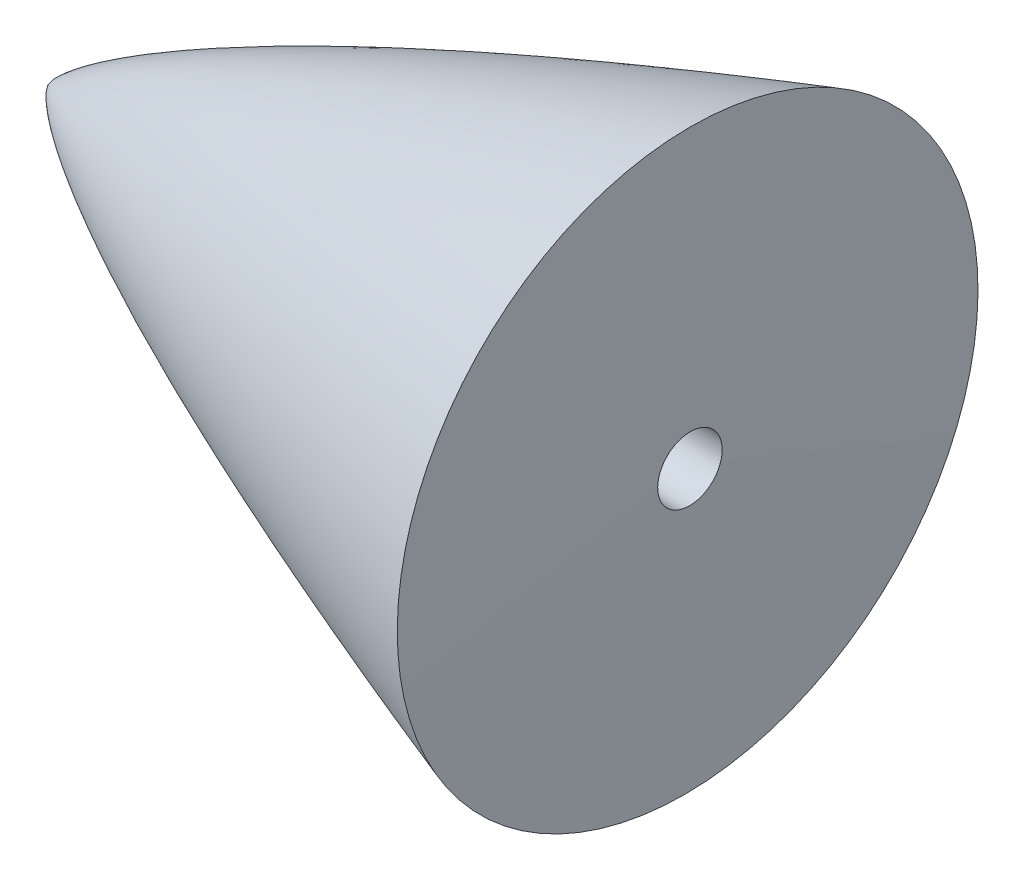
ISO-10303-21;
HEADER;
FILE_DESCRIPTION(('STEP AP214'),'2;1');
FILE_NAME('part.step','',(''),(''),'','','');
FILE_SCHEMA(('AUTOMOTIVE_DESIGN { 1 0 10303 214 1 1 1 1 }'));
ENDSEC;
DATA;
#1=APPLICATION_CONTEXT('core data for automotive mechanical design processes');
#2=APPLICATION_PROTOCOL_DEFINITION('international standard','automotive_design',2000,#1);
#3=PRODUCT_CONTEXT('',#1,'mechanical');
#4=PRODUCT('Part','Part','',(#3));
#5=PRODUCT_RELATED_PRODUCT_CATEGORY('part','',(#4));
#6=PRODUCT_DEFINITION_FORMATION('','',#4);
#7=PRODUCT_DEFINITION_CONTEXT('part definition',#1,'design');
#8=PRODUCT_DEFINITION('design','',#6,#7);
#9=PRODUCT_DEFINITION_SHAPE('','',#8);
#10=(LENGTH_UNIT() NAMED_UNIT(*) SI_UNIT(.MILLI.,.METRE.));
#11=(NAMED_UNIT(*) PLANE_ANGLE_UNIT() SI_UNIT($,.RADIAN.));
#12=(NAMED_UNIT(*) SI_UNIT($,.STERADIAN.) SOLID_ANGLE_UNIT());
#13=UNCERTAINTY_MEASURE_WITH_UNIT(LENGTH_MEASURE(1.E-05),#10,'distance_accuracy_value','');
#14=(GEOMETRIC_REPRESENTATION_CONTEXT(3) GLOBAL_UNCERTAINTY_ASSIGNED_CONTEXT((#13)) GLOBAL_UNIT_ASSIGNED_CONTEXT((#10,
#11,#12)) REPRESENTATION_CONTEXT('',''));
#15=CARTESIAN_POINT('',(0.,0.,0.));
#16=DIRECTION('',(0.,0.,1.));
#17=DIRECTION('',(1.,0.,0.));
#18=AXIS2_PLACEMENT_3D('',#15,#16,#17);
#19=CARTESIAN_POINT('',(50.8000000000005,22.5303567600831,0.));
#20=CARTESIAN_POINT('',(50.3465117854958,22.3812512382409,0.));
#21=CARTESIAN_POINT('',(49.442710434982,22.0829308392967,0.));
#22=CARTESIAN_POINT('',(47.1773804594535,21.3310775343089,0.));
#23=CARTESIAN_POINT('',(44.9449824900996,20.575969254353,0.));
#24=CARTESIAN_POINT('',(42.3170495750487,19.6775947745826,0.));
#25=CARTESIAN_POINT('',(39.9342074399655,18.8455213654888,0.));
#26=CARTESIAN_POINT('',(37.9136867647819,18.1332544680412,0.));
#27=CARTESIAN_POINT('',(35.9736316381102,17.4378758859734,0.));
#28=CARTESIAN_POINT('',(33.9915603629898,16.7185301483629,0.));
#29=CARTESIAN_POINT('',(31.5467375732389,15.8166109871259,0.));
#30=CARTESIAN_POINT('',(28.6052755986588,14.7086926881745,0.));
#31=CARTESIAN_POINT('',(25.195617979637,13.3860362700775,0.));
#32=CARTESIAN_POINT('',(21.3140120710095,11.8194498266795,0.));
#33=CARTESIAN_POINT('',(17.4617236726198,10.1904945755756,0.));
#34=CARTESIAN_POINT('',(13.6413400190153,8.48273894782136,0.));
#35=CARTESIAN_POINT('',(10.0936400641903,6.78232850197087,0.));
#36=CARTESIAN_POINT('',(7.06866265457857,5.20317059368231,0.));
#37=CARTESIAN_POINT('',(4.68834287270004,3.82830118825915,0.));
#38=CARTESIAN_POINT('',(3.03757211642044,2.76626899081453,0.));
#39=CARTESIAN_POINT('',(1.94795210676624,1.98434624807816,0.));
#40=CARTESIAN_POINT('',(1.22079366392824,1.39852484429859,0.));
#41=CARTESIAN_POINT('',(0.755145997118583,0.975924582867757,0.));
#42=CARTESIAN_POINT('',(0.461319422784189,0.674703687613275,0.));
#43=CARTESIAN_POINT('',(0.27829904475557,0.462127291497044,0.));
#44=CARTESIAN_POINT('',(0.165033444135209,0.312533910105992,0.));
#45=CARTESIAN_POINT('',(0.0968927723109344,0.209644328942817,0.));
#46=CARTESIAN_POINT('',(0.0563614371928829,0.139758552997633,0.));
#47=CARTESIAN_POINT('',(0.0275961366881815,0.0824356831018831,0.));
#48=CARTESIAN_POINT('',(0.0110726757431305,0.0442783153926129,0.));
#49=CARTESIAN_POINT('',(0.00340240039888783,0.0179503095970332,0.));
#50=CARTESIAN_POINT('',(0.,0.,0.));
#51=B_SPLINE_CURVE_WITH_KNOTS('',4,(#19,#20,#21,#22,#23,#24,#25,#26,#27,#28,#29,#30,#31,#32,#33,
#34,#35,#36,#37,#38,#39,#40,#41,#42,#43,#44,#45,#46,#47,#48,#49,#50),.UNSPECIFIED.,.F.,.F.,(5,1,
1,1,1,1,1,1,1,1,1,1,1,1,1,1,1,1,1,1,1,1,1,1,1,1,1,1,5),(0.,0.0341314652764168,
0.0682629305528335,0.136525859872037,0.170657325419194,0.204788790966351,0.238920256000712,
0.273051721035072,0.307183186492675,0.341314651950278,0.409577581686297,0.477840513795889,
0.546103441195251,0.614366380584495,0.682629290321098,0.750892221684726,0.802872165882953,
0.837003519315032,0.861991327744609,0.878950290734606,0.890368845138298,0.897914284738923,
0.903010842763492,0.906396837152728,0.908666277387763,0.910152012468246,0.911061650965127,
0.911664755719932,0.912854294796394),.UNSPECIFIED.);
#52=CARTESIAN_POINT('',(0.,0.,0.));
#53=DIRECTION('',(-0.999958208555171,0.00914227231782461,0.));
#54=AXIS1_PLACEMENT('',#52,#53);
#55=SURFACE_OF_REVOLUTION('',#51,#54);
#56=CARTESIAN_POINT('',(0.,0.,0.));
#57=VERTEX_POINT('',#56);
#58=VERTEX_LOOP('',#57);
#59=FACE_BOUND('',#58,.T.);
#60=CARTESIAN_POINT('',(50.5897840291561,-0.462524911678808,0.));
#61=DIRECTION('',(-0.999958208555171,0.00914227231782461,0.));
#62=DIRECTION('',(-0.00914227231782461,-0.999958208555171,0.));
#63=AXIS2_PLACEMENT_3D('',#60,#61,#62);
#64=CIRCLE('',#63,22.9938426176679);
#65=CARTESIAN_POINT('',(50.3795680583122,-23.4554065834416,0.));
#66=VERTEX_POINT('',#65);
#67=EDGE_CURVE('E11',#66,#66,#64,.T.);
#68=ORIENTED_EDGE('',*,*,#67,.T.);
#69=EDGE_LOOP('',(#68));
#70=FACE_BOUND('',#69,.T.);
#71=ADVANCED_FACE('F36',(#59,#70),#55,.T.);
#72=CARTESIAN_POINT('',(50.8,-0.464446843650133,0.));
#73=DIRECTION('',(-0.999958208555171,0.00914227231782461,0.));
#74=DIRECTION('',(-0.00914227231782461,-0.999958208555171,0.));
#75=AXIS2_PLACEMENT_3D('',#72,#73,#74);
#76=CONICAL_SURFACE('',#75,0.,1.56165392711869);
#77=CARTESIAN_POINT('',(50.7514405421361,-2.8563607226494,-1.67309737151764));
#78=CARTESIAN_POINT('',(50.7505841296063,-2.93717644828396,-1.57996674634571));
#79=CARTESIAN_POINT('',(50.7497999914759,-3.0112448269136,-1.48095453308958));
#80=CARTESIAN_POINT('',(50.7483918364705,-3.14434196213453,-1.27322399619832));
#81=CARTESIAN_POINT('',(50.7477679273403,-3.20336059846426,-1.16449920729777));
#82=CARTESIAN_POINT('',(50.7466057086025,-3.31334988802808,-0.921314581499885));
#83=CARTESIAN_POINT('',(50.7460978129312,-3.36145155301971,-0.785544776739851));
#84=CARTESIAN_POINT('',(50.7453300437503,-3.43418368507806,-0.507834177241092));
#85=CARTESIAN_POINT('',(50.7450702469713,-3.45880689084645,-0.365891487566549));
#86=CARTESIAN_POINT('',(50.7448057920375,-3.48387156345968,-0.0799014478196097));
#87=CARTESIAN_POINT('',(50.7448010978481,-3.48431644563201,0.0641456021243835));
#88=CARTESIAN_POINT('',(50.7450469209896,-3.46101689460632,0.350258514592375));
#89=CARTESIAN_POINT('',(50.7452974210271,-3.43727410051355,0.492324510703438));
#90=CARTESIAN_POINT('',(50.7460468579,-3.36627614746372,0.770457492977118));
#91=CARTESIAN_POINT('',(50.7465458001838,-3.31902047285333,0.906524347503266));
#92=CARTESIAN_POINT('',(50.7477786897789,-3.20233712506413,1.1687944924581));
#93=CARTESIAN_POINT('',(50.7485126399295,-3.13290918399867,1.29499766369024));
#94=CARTESIAN_POINT('',(50.750195741857,-2.97385199080143,1.53395743819739));
#95=CARTESIAN_POINT('',(50.7511448953963,-2.88422257323608,1.64671393134356));
#96=CARTESIAN_POINT('',(50.7532327267643,-2.68730735192309,1.85557852297479));
#97=CARTESIAN_POINT('',(50.7543714043865,-2.58002156741731,1.95168663960299));
#98=CARTESIAN_POINT('',(50.7568074220661,-2.35083594899108,2.12452926041214));
#99=CARTESIAN_POINT('',(50.7581047664778,-2.22893571401386,2.20126323273895));
#100=CARTESIAN_POINT('',(50.760822738251,-1.97398398516981,2.33317622345662));
#101=CARTESIAN_POINT('',(50.762243365602,-1.84093249226144,2.38835524370014));
#102=CARTESIAN_POINT('',(50.7651690080239,-1.5674512544145,2.47559350262932));
#103=CARTESIAN_POINT('',(50.7666740254057,-1.42702130743919,2.50765210787772));
#104=CARTESIAN_POINT('',(50.7697268528401,-1.1427727960002,2.54773717917423));
#105=CARTESIAN_POINT('',(50.7712746629065,-0.998954230452183,2.55576363753201));
#106=CARTESIAN_POINT('',(50.7743699459872,-0.71200874272283,2.54755650421177));
#107=CARTESIAN_POINT('',(50.775917418996,-0.568881831264569,2.53132253761456));
#108=CARTESIAN_POINT('',(50.7789683341685,-0.287384878091102,2.47505459583576));
#109=CARTESIAN_POINT('',(50.7804717763354,-0.14901483600634,2.43502062250318));
#110=CARTESIAN_POINT('',(50.783391563577,0.119039977201063,2.33228908134673));
#111=CARTESIAN_POINT('',(50.7848079089063,0.248724773729573,2.26959157982109));
#112=CARTESIAN_POINT('',(50.7875122146572,0.495727951831481,2.12331255418964));
#113=CARTESIAN_POINT('',(50.7888001750867,0.613046334163073,2.03973103136424));
#114=CARTESIAN_POINT('',(50.7912093679939,0.831983912251609,1.85405824893232));
#115=CARTESIAN_POINT('',(50.7923306036718,0.933603409336896,1.75196734468127));
#116=CARTESIAN_POINT('',(50.7943722741747,1.11826091675125,1.53217267803711));
#117=CARTESIAN_POINT('',(50.7952927090251,1.20129892942495,1.41446891761403));
#118=CARTESIAN_POINT('',(50.7969041299064,1.34643400938606,1.16679308611396));
#119=CARTESIAN_POINT('',(50.7975951219003,1.40853162089923,1.03682133398551));
#120=CARTESIAN_POINT('',(50.798725756223,1.51002585460792,0.768296497331849));
#121=CARTESIAN_POINT('',(50.7991653986015,1.54942248129365,0.629743414504022));
#122=CARTESIAN_POINT('',(50.7997791458669,1.60439561948354,0.347992254853583));
#123=CARTESIAN_POINT('',(50.7999532565197,1.61997264820911,0.204794278959652));
#124=CARTESIAN_POINT('',(50.8000302896833,1.62686598052559,-0.0821845241689591));
#125=CARTESIAN_POINT('',(50.7999332121534,1.61818228046272,-0.225965351491416));
#126=CARTESIAN_POINT('',(50.7994710355171,1.57680087554434,-0.51002693822133));
#127=CARTESIAN_POINT('',(50.7991059388479,1.5441033890596,-0.650307729444577));
#128=CARTESIAN_POINT('',(50.7981195435379,1.45562297875133,-0.923388415893206));
#129=CARTESIAN_POINT('',(50.797498245045,1.39984006824768,-1.05618831543488));
#130=CARTESIAN_POINT('',(50.7960192634217,1.26677207346667,-1.31053841210268));
#131=CARTESIAN_POINT('',(50.7951615789097,1.18948686350622,-1.43208854346725));
#132=CARTESIAN_POINT('',(50.7932366622785,1.01560836555483,-1.66048814500519));
#133=CARTESIAN_POINT('',(50.7921694299369,0.919015057071859,-1.76733759957627));
#134=CARTESIAN_POINT('',(50.7898580625002,0.709260548474779,-1.96330473851638));
#135=CARTESIAN_POINT('',(50.7886139241571,0.596099044164108,-2.05242209724845));
#136=CARTESIAN_POINT('',(50.7859859986975,0.356421665642527,-2.21039326844494));
#137=CARTESIAN_POINT('',(50.784602211386,0.229905772775997,-2.27924705260134));
#138=CARTESIAN_POINT('',(50.7817355009982,-0.0328937334359094,-2.39473890699881));
#139=CARTESIAN_POINT('',(50.7802525742996,-0.169177703711857,-2.44137616495998));
#140=CARTESIAN_POINT('',(50.7772303383731,-0.447637605633375,-2.51110662647389));
#141=CARTESIAN_POINT('',(50.7756910304018,-0.589813405970441,-2.53420035443711));
#142=CARTESIAN_POINT('',(50.7725996730609,-0.876018124931123,-2.5561903964113));
#143=CARTESIAN_POINT('',(50.7710476241695,-1.02004697412152,-2.555087614435));
#144=CARTESIAN_POINT('',(50.7679738900274,-1.30589761932847,-2.52871413308505));
#145=CARTESIAN_POINT('',(50.766452209071,-1.44771910258231,-2.50344003998413));
#146=CARTESIAN_POINT('',(50.7634812531531,-1.72513713601805,-2.42943435243064));
#147=CARTESIAN_POINT('',(50.7620319982157,-1.86073196383362,-2.38069630987818));
#148=CARTESIAN_POINT('',(50.7592467589207,-2.12174821695429,-2.26115419788496));
#149=CARTESIAN_POINT('',(50.7579106986294,-2.24717645976485,-2.19036507233279));
#150=CARTESIAN_POINT('',(50.7556843623932,-2.45646721697127,-2.0477794889763));
#151=CARTESIAN_POINT('',(50.7547630356315,-2.54317810167351,-1.98011485967064));
#152=CARTESIAN_POINT('',(50.7530222606583,-2.70715890829395,-1.83421639255701));
#153=CARTESIAN_POINT('',(50.7522027751768,-2.78443228379029,-1.75598644324214));
#154=CARTESIAN_POINT('',(50.7514405421361,-2.8563607226494,-1.67309737151764));
#155=B_SPLINE_CURVE_WITH_KNOTS('',3,(#77,#78,#79,#80,#81,#82,#83,#84,#85,#86,#87,#88,#89,#90,
#91,#92,#93,#94,#95,#96,#97,#98,#99,#100,#101,#102,#103,#104,#105,#106,#107,#108,#109,#110,#111,
#112,#113,#114,#115,#116,#117,#118,#119,#120,#121,#122,#123,#124,#125,#126,#127,#128,#129,#130,
#131,#132,#133,#134,#135,#136,#137,#138,#139,#140,#141,#142,#143,#144,#145,#146,#147,#148,#149,
#150,#151,#152,#153,#154),.UNSPECIFIED.,.T.,.F.,(4,2,2,2,2,2,2,2,2,2,2,2,2,2,2,2,2,2,2,2,2,2,2,
2,2,2,2,2,2,2,2,2,2,2,2,2,2,2,4),(0.,0.369632563386502,0.739513036116207,1.16953616373014,
1.5996922436114,2.02978756131045,2.45985373505214,2.88992934085102,3.32001014304574,
3.75009446737823,4.18017832300873,4.61027398390967,5.04036960784349,5.4704770147944,
5.90058455938061,6.33069875089244,6.76081290898901,7.19092580887117,7.62103868238282,
8.05114329917403,8.4812478616942,8.91134124524869,9.34143454373154,9.77151850298799,
10.2016025270172,10.6316826401007,11.0617625050359,11.4918448838836,11.9219277191876,
12.3520184519193,12.7821097854809,13.212216842821,13.6423143197127,14.0723957276371,
14.5025375291954,14.9327976050409,15.3627667282158,15.6918716799444,16.020855835282),.UNSPECIFIED.);
#156=CARTESIAN_POINT('',(50.7514405421361,-2.8563607226494,-1.67309737151764));
#157=VERTEX_POINT('',#156);
#158=EDGE_CURVE('E40',#157,#157,#155,.T.);
#159=ORIENTED_EDGE('',*,*,#158,.T.);
#160=EDGE_LOOP('',(#159));
#161=FACE_BOUND('',#160,.T.);
#162=ORIENTED_EDGE('',*,*,#67,.F.);
#163=EDGE_LOOP('',(#162));
#164=FACE_BOUND('',#163,.T.);
#165=ADVANCED_FACE('F72',(#161,#164),#76,.T.);
#166=CARTESIAN_POINT('',(50.7915081558575,-0.928816049304032,3.5291796143131E-06));
#167=DIRECTION('',(0.999832837713736,-0.0182837804978471,6.94720396487991E-08));
#168=DIRECTION('',(0.0182837804978471,0.999832837713738,0.));
#169=AXIS2_PLACEMENT_3D('',#166,#167,#168);
#170=CYLINDRICAL_SURFACE('',#169,2.55269999999999);
#171=CARTESIAN_POINT('',(25.3957540779286,-0.464408024658716,1.7645898072336E-06));
#172=DIRECTION('',(0.999832837713736,-0.0182837804978471,6.94720396487991E-08));
#173=DIRECTION('',(0.0182837804978471,0.999832837713738,0.));
#174=AXIS2_PLACEMENT_3D('',#171,#172,#173);
#175=CIRCLE('',#174,2.5527);
#176=CARTESIAN_POINT('',(25.4424270844055,2.08786526017314,1.7645898072336E-06));
#177=VERTEX_POINT('',#176);
#178=EDGE_CURVE('E60',#177,#177,#175,.T.);
#179=ORIENTED_EDGE('',*,*,#178,.F.);
#180=EDGE_LOOP('',(#179));
#181=FACE_BOUND('',#180,.T.);
#182=ORIENTED_EDGE('',*,*,#158,.F.);
#183=EDGE_LOOP('',(#182));
#184=FACE_BOUND('',#183,.T.);
#185=ADVANCED_FACE('F56',(#181,#184),#170,.F.);
#186=CARTESIAN_POINT('',(25.3957540779286,-0.464408024658716,1.7645898072336E-06));
#187=DIRECTION('',(0.999832837713736,-0.0182837804978471,6.94720396487991E-08));
#188=DIRECTION('',(0.0182837804978471,0.999832837713738,0.));
#189=AXIS2_PLACEMENT_3D('',#186,#187,#188);
#190=CONICAL_SURFACE('',#189,2.5527,1.02974425867665);
#191=CARTESIAN_POINT('',(23.862193572077,-0.436364053095161,1.65803241392623E-06));
#192=VERTEX_POINT('',#191);
#193=VERTEX_LOOP('',#192);
#194=FACE_BOUND('',#193,.T.);
#195=ORIENTED_EDGE('',*,*,#178,.T.);
#196=EDGE_LOOP('',(#195));
#197=FACE_BOUND('',#196,.T.);
#198=ADVANCED_FACE('F53',(#194,#197),#190,.F.);
#199=CLOSED_SHELL('',(#71,#165,#185,#198));
#200=MANIFOLD_SOLID_BREP('B2',#199);
#201=ADVANCED_BREP_SHAPE_REPRESENTATION('',(#18,#200),#14);
#202=SHAPE_DEFINITION_REPRESENTATION(#9,#201);
ENDSEC;
END-ISO-10303-21;
